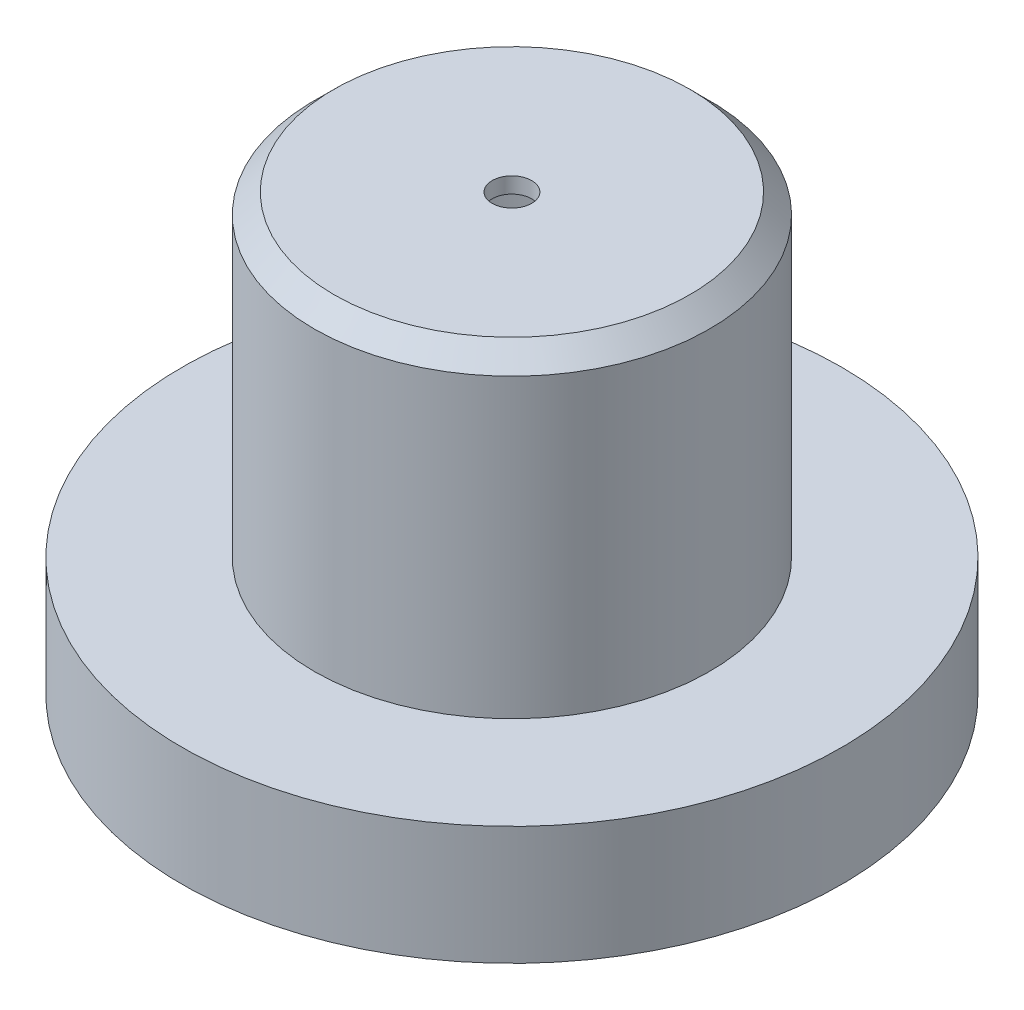
ISO-10303-21;
HEADER;
FILE_DESCRIPTION(('STEP AP214'),'2;1');
FILE_NAME('part.step','',(''),(''),'','','');
FILE_SCHEMA(('AUTOMOTIVE_DESIGN { 1 0 10303 214 1 1 1 1 }'));
ENDSEC;
DATA;
#1=APPLICATION_CONTEXT('core data for automotive mechanical design processes');
#2=APPLICATION_PROTOCOL_DEFINITION('international standard','automotive_design',2000,#1);
#3=PRODUCT_CONTEXT('',#1,'mechanical');
#4=PRODUCT('Part','Part','',(#3));
#5=PRODUCT_RELATED_PRODUCT_CATEGORY('part','',(#4));
#6=PRODUCT_DEFINITION_FORMATION('','',#4);
#7=PRODUCT_DEFINITION_CONTEXT('part definition',#1,'design');
#8=PRODUCT_DEFINITION('design','',#6,#7);
#9=PRODUCT_DEFINITION_SHAPE('','',#8);
#10=(LENGTH_UNIT() NAMED_UNIT(*) SI_UNIT(.MILLI.,.METRE.));
#11=(NAMED_UNIT(*) PLANE_ANGLE_UNIT() SI_UNIT($,.RADIAN.));
#12=(NAMED_UNIT(*) SI_UNIT($,.STERADIAN.) SOLID_ANGLE_UNIT());
#13=UNCERTAINTY_MEASURE_WITH_UNIT(LENGTH_MEASURE(1.E-05),#10,'distance_accuracy_value','');
#14=(GEOMETRIC_REPRESENTATION_CONTEXT(3) GLOBAL_UNCERTAINTY_ASSIGNED_CONTEXT((#13)) GLOBAL_UNIT_ASSIGNED_CONTEXT((#10,
#11,#12)) REPRESENTATION_CONTEXT('',''));
#15=CARTESIAN_POINT('',(0.,0.,0.));
#16=DIRECTION('',(0.,0.,1.));
#17=DIRECTION('',(1.,0.,0.));
#18=AXIS2_PLACEMENT_3D('',#15,#16,#17);
#19=CARTESIAN_POINT('',(0.,130.,0.));
#20=DIRECTION('',(0.,-1.,0.));
#21=DIRECTION('',(0.,0.,-1.));
#22=AXIS2_PLACEMENT_3D('',#19,#20,#21);
#23=CYLINDRICAL_SURFACE('',#22,50.);
#24=CARTESIAN_POINT('',(0.,125.,0.));
#25=DIRECTION('',(0.,1.,0.));
#26=DIRECTION('',(0.,0.,1.));
#27=AXIS2_PLACEMENT_3D('',#24,#25,#26);
#28=CIRCLE('',#27,50.);
#29=CARTESIAN_POINT('',(0.,125.,50.));
#30=VERTEX_POINT('',#29);
#31=EDGE_CURVE('E10',#30,#30,#28,.F.);
#32=ORIENTED_EDGE('',*,*,#31,.T.);
#33=EDGE_LOOP('',(#32));
#34=FACE_BOUND('',#33,.T.);
#35=CARTESIAN_POINT('',(0.,50.,0.));
#36=DIRECTION('',(0.,1.,0.));
#37=DIRECTION('',(0.,0.,1.));
#38=AXIS2_PLACEMENT_3D('',#35,#36,#37);
#39=CIRCLE('',#38,50.);
#40=CARTESIAN_POINT('',(0.,50.,50.));
#41=VERTEX_POINT('',#40);
#42=EDGE_CURVE('E45',#41,#41,#39,.T.);
#43=ORIENTED_EDGE('',*,*,#42,.T.);
#44=EDGE_LOOP('',(#43));
#45=FACE_BOUND('',#44,.T.);
#46=ADVANCED_FACE('F33',(#34,#45),#23,.T.);
#47=CARTESIAN_POINT('',(0.,130.,0.));
#48=DIRECTION('',(0.,1.,0.));
#49=DIRECTION('',(0.,0.,1.));
#50=AXIS2_PLACEMENT_3D('',#47,#48,#49);
#51=PLANE('',#50);
#52=CARTESIAN_POINT('',(0.,130.,0.));
#53=DIRECTION('',(0.,1.,0.));
#54=DIRECTION('',(0.,0.,1.));
#55=AXIS2_PLACEMENT_3D('',#52,#53,#54);
#56=CIRCLE('',#55,5.);
#57=CARTESIAN_POINT('',(0.,130.,5.));
#58=VERTEX_POINT('',#57);
#59=EDGE_CURVE('E71',#58,#58,#56,.T.);
#60=ORIENTED_EDGE('',*,*,#59,.F.);
#61=EDGE_LOOP('',(#60));
#62=FACE_BOUND('',#61,.T.);
#63=CARTESIAN_POINT('',(0.,130.,0.));
#64=DIRECTION('',(0.,1.,0.));
#65=DIRECTION('',(0.,0.,1.));
#66=AXIS2_PLACEMENT_3D('',#63,#64,#65);
#67=CIRCLE('',#66,45.);
#68=CARTESIAN_POINT('',(0.,130.,45.));
#69=VERTEX_POINT('',#68);
#70=EDGE_CURVE('E41',#69,#69,#67,.T.);
#71=ORIENTED_EDGE('',*,*,#70,.T.);
#72=EDGE_LOOP('',(#71));
#73=FACE_BOUND('',#72,.T.);
#74=ADVANCED_FACE('F93',(#62,#73),#51,.T.);
#75=CARTESIAN_POINT('',(0.,130.,0.));
#76=DIRECTION('',(0.,-1.,0.));
#77=DIRECTION('',(0.,0.,-1.));
#78=AXIS2_PLACEMENT_3D('',#75,#76,#77);
#79=CONICAL_SURFACE('',#78,45.,0.785398163397447);
#80=ORIENTED_EDGE('',*,*,#31,.F.);
#81=EDGE_LOOP('',(#80));
#82=FACE_BOUND('',#81,.T.);
#83=ORIENTED_EDGE('',*,*,#70,.F.);
#84=EDGE_LOOP('',(#83));
#85=FACE_BOUND('',#84,.T.);
#86=ADVANCED_FACE('F35',(#82,#85),#79,.T.);
#87=CARTESIAN_POINT('',(0.,20.,0.));
#88=DIRECTION('',(0.,1.,0.));
#89=DIRECTION('',(0.,0.,1.));
#90=AXIS2_PLACEMENT_3D('',#87,#88,#89);
#91=CYLINDRICAL_SURFACE('',#90,83.3335);
#92=CARTESIAN_POINT('',(0.,20.,0.));
#93=DIRECTION('',(0.,-1.,0.));
#94=DIRECTION('',(0.,0.,-1.));
#95=AXIS2_PLACEMENT_3D('',#92,#93,#94);
#96=CIRCLE('',#95,83.3335);
#97=CARTESIAN_POINT('',(0.,20.,-83.3335));
#98=VERTEX_POINT('',#97);
#99=EDGE_CURVE('E50',#98,#98,#96,.T.);
#100=ORIENTED_EDGE('',*,*,#99,.F.);
#101=EDGE_LOOP('',(#100));
#102=FACE_BOUND('',#101,.T.);
#103=CARTESIAN_POINT('',(0.,50.,0.));
#104=DIRECTION('',(0.,-1.,0.));
#105=DIRECTION('',(0.,0.,-1.));
#106=AXIS2_PLACEMENT_3D('',#103,#104,#105);
#107=CIRCLE('',#106,83.3335);
#108=CARTESIAN_POINT('',(0.,50.,-83.3335));
#109=VERTEX_POINT('',#108);
#110=EDGE_CURVE('E51',#109,#109,#107,.T.);
#111=ORIENTED_EDGE('',*,*,#110,.T.);
#112=EDGE_LOOP('',(#111));
#113=FACE_BOUND('',#112,.T.);
#114=ADVANCED_FACE('F101',(#102,#113),#91,.T.);
#115=CARTESIAN_POINT('',(0.,20.,0.));
#116=DIRECTION('',(0.,-1.,0.));
#117=DIRECTION('',(0.,0.,-1.));
#118=AXIS2_PLACEMENT_3D('',#115,#116,#117);
#119=PLANE('',#118);
#120=CARTESIAN_POINT('',(0.,20.,0.));
#121=DIRECTION('',(0.,-1.,0.));
#122=DIRECTION('',(0.,0.,-1.));
#123=AXIS2_PLACEMENT_3D('',#120,#121,#122);
#124=CIRCLE('',#123,79.3335);
#125=CARTESIAN_POINT('',(0.,20.,-79.3335));
#126=VERTEX_POINT('',#125);
#127=EDGE_CURVE('E57',#126,#126,#124,.T.);
#128=ORIENTED_EDGE('',*,*,#127,.F.);
#129=EDGE_LOOP('',(#128));
#130=FACE_BOUND('',#129,.T.);
#131=ORIENTED_EDGE('',*,*,#99,.T.);
#132=EDGE_LOOP('',(#131));
#133=FACE_BOUND('',#132,.T.);
#134=ADVANCED_FACE('F104',(#130,#133),#119,.T.);
#135=CARTESIAN_POINT('',(0.,50.,0.));
#136=DIRECTION('',(0.,-1.,0.));
#137=DIRECTION('',(0.,0.,-1.));
#138=AXIS2_PLACEMENT_3D('',#135,#136,#137);
#139=PLANE('',#138);
#140=ORIENTED_EDGE('',*,*,#42,.F.);
#141=EDGE_LOOP('',(#140));
#142=FACE_BOUND('',#141,.T.);
#143=ORIENTED_EDGE('',*,*,#110,.F.);
#144=EDGE_LOOP('',(#143));
#145=FACE_BOUND('',#144,.T.);
#146=ADVANCED_FACE('F106',(#142,#145),#139,.F.);
#147=CARTESIAN_POINT('',(0.,130.,0.));
#148=DIRECTION('',(0.,-1.,0.));
#149=DIRECTION('',(0.,0.,-1.));
#150=AXIS2_PLACEMENT_3D('',#147,#148,#149);
#151=CYLINDRICAL_SURFACE('',#150,46.);
#152=CARTESIAN_POINT('',(0.,123.343145750508,0.));
#153=DIRECTION('',(0.,-1.,0.));
#154=DIRECTION('',(0.,0.,-1.));
#155=AXIS2_PLACEMENT_3D('',#152,#153,#154);
#156=CIRCLE('',#155,46.);
#157=CARTESIAN_POINT('',(0.,123.343145750508,-46.));
#158=VERTEX_POINT('',#157);
#159=EDGE_CURVE('E54',#158,#158,#156,.T.);
#160=ORIENTED_EDGE('',*,*,#159,.F.);
#161=EDGE_LOOP('',(#160));
#162=FACE_BOUND('',#161,.T.);
#163=CARTESIAN_POINT('',(0.,46.,0.));
#164=DIRECTION('',(0.,-1.,0.));
#165=DIRECTION('',(0.,0.,-1.));
#166=AXIS2_PLACEMENT_3D('',#163,#164,#165);
#167=CIRCLE('',#166,46.);
#168=CARTESIAN_POINT('',(0.,46.,-46.));
#169=VERTEX_POINT('',#168);
#170=EDGE_CURVE('E60',#169,#169,#167,.F.);
#171=ORIENTED_EDGE('',*,*,#170,.F.);
#172=EDGE_LOOP('',(#171));
#173=FACE_BOUND('',#172,.T.);
#174=ADVANCED_FACE('F109',(#162,#173),#151,.F.);
#175=CARTESIAN_POINT('',(0.,126.,0.));
#176=DIRECTION('',(0.,1.,0.));
#177=DIRECTION('',(0.,0.,1.));
#178=AXIS2_PLACEMENT_3D('',#175,#176,#177);
#179=PLANE('',#178);
#180=CARTESIAN_POINT('',(0.,126.,0.));
#181=DIRECTION('',(0.,1.,0.));
#182=DIRECTION('',(0.,0.,1.));
#183=AXIS2_PLACEMENT_3D('',#180,#181,#182);
#184=CIRCLE('',#183,5.);
#185=CARTESIAN_POINT('',(0.,126.,5.));
#186=VERTEX_POINT('',#185);
#187=EDGE_CURVE('E37',#186,#186,#184,.T.);
#188=ORIENTED_EDGE('',*,*,#187,.T.);
#189=EDGE_LOOP('',(#188));
#190=FACE_BOUND('',#189,.T.);
#191=CARTESIAN_POINT('',(0.,126.,0.));
#192=DIRECTION('',(0.,1.,0.));
#193=DIRECTION('',(0.,0.,1.));
#194=AXIS2_PLACEMENT_3D('',#191,#192,#193);
#195=CIRCLE('',#194,43.3431457505076);
#196=CARTESIAN_POINT('',(0.,126.,43.3431457505076));
#197=VERTEX_POINT('',#196);
#198=EDGE_CURVE('E64',#197,#197,#195,.T.);
#199=ORIENTED_EDGE('',*,*,#198,.F.);
#200=EDGE_LOOP('',(#199));
#201=FACE_BOUND('',#200,.T.);
#202=ADVANCED_FACE('F78',(#190,#201),#179,.F.);
#203=CARTESIAN_POINT('',(0.,127.171572875254,0.));
#204=DIRECTION('',(0.,-1.,0.));
#205=DIRECTION('',(0.,0.,-1.));
#206=AXIS2_PLACEMENT_3D('',#203,#204,#205);
#207=CONICAL_SURFACE('',#206,42.1715728752538,0.785398163397447);
#208=ORIENTED_EDGE('',*,*,#159,.T.);
#209=EDGE_LOOP('',(#208));
#210=FACE_BOUND('',#209,.T.);
#211=ORIENTED_EDGE('',*,*,#198,.T.);
#212=EDGE_LOOP('',(#211));
#213=FACE_BOUND('',#212,.T.);
#214=ADVANCED_FACE('F116',(#210,#213),#207,.F.);
#215=CARTESIAN_POINT('',(0.,20.,0.));
#216=DIRECTION('',(0.,1.,0.));
#217=DIRECTION('',(0.,0.,1.));
#218=AXIS2_PLACEMENT_3D('',#215,#216,#217);
#219=CYLINDRICAL_SURFACE('',#218,79.3335);
#220=ORIENTED_EDGE('',*,*,#127,.T.);
#221=EDGE_LOOP('',(#220));
#222=FACE_BOUND('',#221,.T.);
#223=CARTESIAN_POINT('',(0.,46.,0.));
#224=DIRECTION('',(0.,-1.,0.));
#225=DIRECTION('',(0.,0.,-1.));
#226=AXIS2_PLACEMENT_3D('',#223,#224,#225);
#227=CIRCLE('',#226,79.3335);
#228=CARTESIAN_POINT('',(0.,46.,-79.3335));
#229=VERTEX_POINT('',#228);
#230=EDGE_CURVE('E61',#229,#229,#227,.T.);
#231=ORIENTED_EDGE('',*,*,#230,.F.);
#232=EDGE_LOOP('',(#231));
#233=FACE_BOUND('',#232,.T.);
#234=ADVANCED_FACE('F88',(#222,#233),#219,.F.);
#235=CARTESIAN_POINT('',(0.,46.,0.));
#236=DIRECTION('',(0.,-1.,0.));
#237=DIRECTION('',(0.,0.,-1.));
#238=AXIS2_PLACEMENT_3D('',#235,#236,#237);
#239=PLANE('',#238);
#240=ORIENTED_EDGE('',*,*,#170,.T.);
#241=EDGE_LOOP('',(#240));
#242=FACE_BOUND('',#241,.T.);
#243=ORIENTED_EDGE('',*,*,#230,.T.);
#244=EDGE_LOOP('',(#243));
#245=FACE_BOUND('',#244,.T.);
#246=ADVANCED_FACE('F83',(#242,#245),#239,.T.);
#247=CARTESIAN_POINT('',(0.,-79.,0.));
#248=DIRECTION('',(0.,1.,0.));
#249=DIRECTION('',(0.,0.,1.));
#250=AXIS2_PLACEMENT_3D('',#247,#248,#249);
#251=CYLINDRICAL_SURFACE('',#250,5.);
#252=CARTESIAN_POINT('',(0.,130.,5.));
#253=CARTESIAN_POINT('',(0.,129.958333333333,5.));
#254=CARTESIAN_POINT('',(0.,129.916666666667,5.));
#255=CARTESIAN_POINT('',(0.,129.833333333333,5.));
#256=CARTESIAN_POINT('',(0.,129.791666666667,5.));
#257=CARTESIAN_POINT('',(0.,129.708333333333,5.));
#258=CARTESIAN_POINT('',(0.,129.666666666667,5.));
#259=CARTESIAN_POINT('',(0.,129.583333333333,5.));
#260=CARTESIAN_POINT('',(0.,129.541666666667,5.));
#261=CARTESIAN_POINT('',(0.,129.458333333333,5.));
#262=CARTESIAN_POINT('',(0.,129.416666666667,5.));
#263=CARTESIAN_POINT('',(0.,129.333333333333,5.));
#264=CARTESIAN_POINT('',(0.,129.291666666667,5.));
#265=CARTESIAN_POINT('',(0.,129.208333333333,5.));
#266=CARTESIAN_POINT('',(0.,129.166666666667,5.));
#267=CARTESIAN_POINT('',(0.,129.083333333333,5.));
#268=CARTESIAN_POINT('',(0.,129.041666666667,5.));
#269=CARTESIAN_POINT('',(0.,128.958333333333,5.));
#270=CARTESIAN_POINT('',(0.,128.916666666667,5.));
#271=CARTESIAN_POINT('',(0.,128.833333333333,5.));
#272=CARTESIAN_POINT('',(0.,128.791666666667,5.));
#273=CARTESIAN_POINT('',(0.,128.708333333333,5.));
#274=CARTESIAN_POINT('',(0.,128.666666666667,5.));
#275=CARTESIAN_POINT('',(0.,128.583333333333,5.));
#276=CARTESIAN_POINT('',(0.,128.541666666667,5.));
#277=CARTESIAN_POINT('',(0.,128.458333333333,5.));
#278=CARTESIAN_POINT('',(0.,128.416666666667,5.));
#279=CARTESIAN_POINT('',(0.,128.333333333333,5.));
#280=CARTESIAN_POINT('',(0.,128.291666666667,5.));
#281=CARTESIAN_POINT('',(0.,128.208333333333,5.));
#282=CARTESIAN_POINT('',(0.,128.166666666667,5.));
#283=CARTESIAN_POINT('',(0.,128.083333333333,5.));
#284=CARTESIAN_POINT('',(0.,128.041666666667,5.));
#285=CARTESIAN_POINT('',(0.,127.958333333333,5.));
#286=CARTESIAN_POINT('',(0.,127.916666666667,5.));
#287=CARTESIAN_POINT('',(0.,127.833333333333,5.));
#288=CARTESIAN_POINT('',(0.,127.791666666667,5.));
#289=CARTESIAN_POINT('',(0.,127.708333333333,5.));
#290=CARTESIAN_POINT('',(0.,127.666666666667,5.));
#291=CARTESIAN_POINT('',(0.,127.583333333333,5.));
#292=CARTESIAN_POINT('',(0.,127.541666666667,5.));
#293=CARTESIAN_POINT('',(0.,127.458333333333,5.));
#294=CARTESIAN_POINT('',(0.,127.416666666667,5.));
#295=CARTESIAN_POINT('',(0.,127.333333333333,5.));
#296=CARTESIAN_POINT('',(0.,127.291666666667,5.));
#297=CARTESIAN_POINT('',(0.,127.208333333333,5.));
#298=CARTESIAN_POINT('',(0.,127.166666666667,5.));
#299=CARTESIAN_POINT('',(0.,127.083333333333,5.));
#300=CARTESIAN_POINT('',(0.,127.041666666667,5.));
#301=CARTESIAN_POINT('',(0.,126.958333333333,5.));
#302=CARTESIAN_POINT('',(0.,126.916666666667,5.));
#303=CARTESIAN_POINT('',(0.,126.833333333333,5.));
#304=CARTESIAN_POINT('',(0.,126.791666666667,5.));
#305=CARTESIAN_POINT('',(0.,126.708333333333,5.));
#306=CARTESIAN_POINT('',(0.,126.666666666667,5.));
#307=CARTESIAN_POINT('',(0.,126.583333333333,5.));
#308=CARTESIAN_POINT('',(0.,126.541666666667,5.));
#309=CARTESIAN_POINT('',(0.,126.458333333333,5.));
#310=CARTESIAN_POINT('',(0.,126.416666666667,5.));
#311=CARTESIAN_POINT('',(0.,126.333333333333,5.));
#312=CARTESIAN_POINT('',(0.,126.291666666667,5.));
#313=CARTESIAN_POINT('',(0.,126.208333333333,5.));
#314=CARTESIAN_POINT('',(0.,126.166666666667,5.));
#315=CARTESIAN_POINT('',(0.,126.083333333333,5.));
#316=CARTESIAN_POINT('',(0.,126.041666666667,5.));
#317=CARTESIAN_POINT('',(0.,126.,5.));
#318=B_SPLINE_CURVE_WITH_KNOTS('',3,(#252,#253,#254,#255,#256,#257,#258,#259,#260,#261,#262,
#263,#264,#265,#266,#267,#268,#269,#270,#271,#272,#273,#274,#275,#276,#277,#278,#279,#280,#281,
#282,#283,#284,#285,#286,#287,#288,#289,#290,#291,#292,#293,#294,#295,#296,#297,#298,#299,#300,
#301,#302,#303,#304,#305,#306,#307,#308,#309,#310,#311,#312,#313,#314,#315,#316,#317),
.UNSPECIFIED.,.F.,.F.,(4,2,2,2,2,2,2,2,2,2,2,2,2,2,2,2,2,2,2,2,2,2,2,2,2,2,2,2,2,2,2,2,4),(0.,
0.124999999999986,0.25,0.375000000000014,0.5,0.624999999999987,0.750000000000001,
0.875000000000015,1.,1.12499999999999,1.25,1.37500000000002,1.5,1.62499999999999,1.75,
1.87500000000002,2.,2.12499999999999,2.25,2.37500000000002,2.5,2.62499999999999,2.75,
2.87500000000002,3.,3.12499999999999,3.25,3.37500000000002,3.5,3.62499999999999,3.75,
3.87500000000002,4.),.UNSPECIFIED.);
#319=EDGE_CURVE('BSEAM81',#58,#186,#318,.T.);
#320=ORIENTED_EDGE('',*,*,#59,.T.);
#321=ORIENTED_EDGE('',*,*,#187,.F.);
#322=ORIENTED_EDGE('',*,*,#319,.T.);
#323=ORIENTED_EDGE('',*,*,#319,.F.);
#324=EDGE_LOOP('',(#320,#322,#321,#323));
#325=FACE_BOUND('',#324,.T.);
#326=ADVANCED_FACE('F81',(#325),#251,.F.);
#327=CLOSED_SHELL('',(#46,#74,#86,#114,#134,#146,#174,#202,#214,#234,#246,#326));
#328=MANIFOLD_SOLID_BREP('B2',#327);
#329=ADVANCED_BREP_SHAPE_REPRESENTATION('',(#18,#328),#14);
#330=SHAPE_DEFINITION_REPRESENTATION(#9,#329);
ENDSEC;
END-ISO-10303-21;
